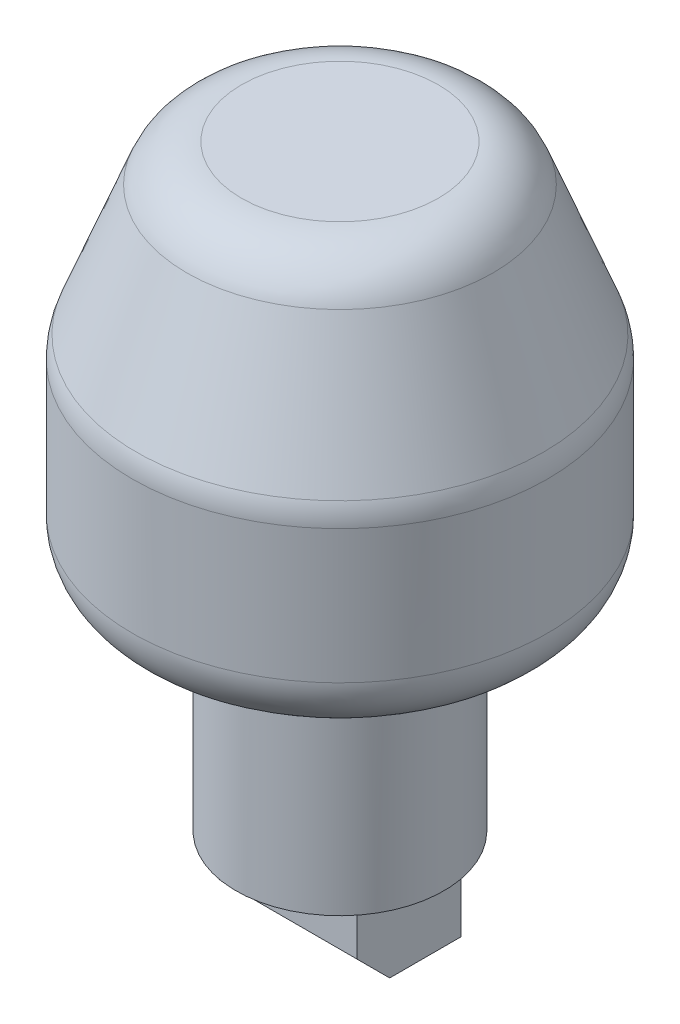
ISO-10303-21;
HEADER;
FILE_DESCRIPTION(('STEP AP214'),'2;1');
FILE_NAME('part.step','',(''),(''),'','','');
FILE_SCHEMA(('AUTOMOTIVE_DESIGN { 1 0 10303 214 1 1 1 1 }'));
ENDSEC;
DATA;
#1=APPLICATION_CONTEXT('core data for automotive mechanical design processes');
#2=APPLICATION_PROTOCOL_DEFINITION('international standard','automotive_design',2000,#1);
#3=PRODUCT_CONTEXT('',#1,'mechanical');
#4=PRODUCT('Part','Part','',(#3));
#5=PRODUCT_RELATED_PRODUCT_CATEGORY('part','',(#4));
#6=PRODUCT_DEFINITION_FORMATION('','',#4);
#7=PRODUCT_DEFINITION_CONTEXT('part definition',#1,'design');
#8=PRODUCT_DEFINITION('design','',#6,#7);
#9=PRODUCT_DEFINITION_SHAPE('','',#8);
#10=(LENGTH_UNIT() NAMED_UNIT(*) SI_UNIT(.MILLI.,.METRE.));
#11=(NAMED_UNIT(*) PLANE_ANGLE_UNIT() SI_UNIT($,.RADIAN.));
#12=(NAMED_UNIT(*) SI_UNIT($,.STERADIAN.) SOLID_ANGLE_UNIT());
#13=UNCERTAINTY_MEASURE_WITH_UNIT(LENGTH_MEASURE(1.E-05),#10,'distance_accuracy_value','');
#14=(GEOMETRIC_REPRESENTATION_CONTEXT(3) GLOBAL_UNCERTAINTY_ASSIGNED_CONTEXT((#13)) GLOBAL_UNIT_ASSIGNED_CONTEXT((#10,
#11,#12)) REPRESENTATION_CONTEXT('',''));
#15=CARTESIAN_POINT('',(0.,0.,0.));
#16=DIRECTION('',(0.,0.,1.));
#17=DIRECTION('',(1.,0.,0.));
#18=AXIS2_PLACEMENT_3D('',#15,#16,#17);
#19=CARTESIAN_POINT('',(7.4549,-9.01718142394338,0.));
#20=DIRECTION('',(0.,-1.,0.));
#21=DIRECTION('',(0.,0.,-1.));
#22=AXIS2_PLACEMENT_3D('',#19,#20,#21);
#23=PLANE('',#22);
#24=DIRECTION('',(0.,0.,1.));
#25=VECTOR('',#24,1.);
#26=CARTESIAN_POINT('',(7.3279,-9.01718142394338,0.));
#27=LINE('',#26,#25);
#28=CARTESIAN_POINT('',(7.3279,-9.01718142394338,-5.49919071197169));
#29=VERTEX_POINT('',#28);
#30=CARTESIAN_POINT('',(7.3279,-9.01718142394338,1.9430092880283));
#31=VERTEX_POINT('',#30);
#32=EDGE_CURVE('E59',#29,#31,#27,.T.);
#33=ORIENTED_EDGE('',*,*,#32,.F.);
#34=DIRECTION('',(1.,0.,0.));
#35=VECTOR('',#34,1.);
#36=CARTESIAN_POINT('',(0.,-9.01718142394338,-5.49919071197169));
#37=LINE('',#36,#35);
#38=CARTESIAN_POINT('',(2.54762,-9.01718142394338,-5.49919071197169));
#39=VERTEX_POINT('',#38);
#40=EDGE_CURVE('E210',#39,#29,#37,.T.);
#41=ORIENTED_EDGE('',*,*,#40,.F.);
#42=DIRECTION('',(0.,0.,-1.));
#43=VECTOR('',#42,1.);
#44=CARTESIAN_POINT('',(2.54762,-9.01718142394338,0.));
#45=LINE('',#44,#43);
#46=CARTESIAN_POINT('',(2.54762,-9.01718142394338,1.94300928802831));
#47=VERTEX_POINT('',#46);
#48=EDGE_CURVE('E225',#47,#39,#45,.T.);
#49=ORIENTED_EDGE('',*,*,#48,.F.);
#50=DIRECTION('',(-1.,0.,0.));
#51=VECTOR('',#50,1.);
#52=CARTESIAN_POINT('',(0.,-9.01718142394338,1.9430092880283));
#53=LINE('',#52,#51);
#54=EDGE_CURVE('E221',#31,#47,#53,.T.);
#55=ORIENTED_EDGE('',*,*,#54,.F.);
#56=EDGE_LOOP('',(#33,#41,#49,#55));
#57=FACE_BOUND('',#56,.T.);
#58=DIRECTION('',(-1.,0.,0.));
#59=VECTOR('',#58,1.);
#60=CARTESIAN_POINT('',(0.,-9.01718142394338,1.9430092880283));
#61=LINE('',#60,#59);
#62=CARTESIAN_POINT('',(-2.54762,-9.01718142394338,1.9430092880283));
#63=VERTEX_POINT('',#62);
#64=CARTESIAN_POINT('',(-7.3279,-9.01718142394338,1.9430092880283));
#65=VERTEX_POINT('',#64);
#66=EDGE_CURVE('E285',#63,#65,#61,.T.);
#67=ORIENTED_EDGE('',*,*,#66,.F.);
#68=DIRECTION('',(0.,0.,-1.));
#69=VECTOR('',#68,1.);
#70=CARTESIAN_POINT('',(-2.54762,-9.01718142394338,0.));
#71=LINE('',#70,#69);
#72=CARTESIAN_POINT('',(-2.54762,-9.01718142394338,-5.49919071197169));
#73=VERTEX_POINT('',#72);
#74=EDGE_CURVE('E263',#63,#73,#71,.T.);
#75=ORIENTED_EDGE('',*,*,#74,.T.);
#76=DIRECTION('',(1.,0.,0.));
#77=VECTOR('',#76,1.);
#78=CARTESIAN_POINT('',(0.,-9.01718142394338,-5.49919071197169));
#79=LINE('',#78,#77);
#80=CARTESIAN_POINT('',(-7.3279,-9.01718142394338,-5.49919071197169));
#81=VERTEX_POINT('',#80);
#82=EDGE_CURVE('E273',#81,#73,#79,.T.);
#83=ORIENTED_EDGE('',*,*,#82,.F.);
#84=DIRECTION('',(0.,0.,-1.));
#85=VECTOR('',#84,1.);
#86=CARTESIAN_POINT('',(-7.3279,-9.01718142394338,0.));
#87=LINE('',#86,#85);
#88=EDGE_CURVE('E288',#65,#81,#87,.T.);
#89=ORIENTED_EDGE('',*,*,#88,.F.);
#90=EDGE_LOOP('',(#67,#75,#83,#89));
#91=FACE_BOUND('',#90,.T.);
#92=DIRECTION('',(0.,0.,1.));
#93=VECTOR('',#92,1.);
#94=CARTESIAN_POINT('',(-7.4549,-9.01718142394338,0.));
#95=LINE('',#94,#93);
#96=CARTESIAN_POINT('',(-7.4549,-9.01718142394338,-5.6261907119717));
#97=VERTEX_POINT('',#96);
#98=CARTESIAN_POINT('',(-7.4549,-9.01718142394338,2.0700092880283));
#99=VERTEX_POINT('',#98);
#100=EDGE_CURVE('E323',#97,#99,#95,.T.);
#101=ORIENTED_EDGE('',*,*,#100,.F.);
#102=DIRECTION('',(-1.,0.,0.));
#103=VECTOR('',#102,1.);
#104=CARTESIAN_POINT('',(7.4549,-9.01718142394338,-5.6261907119717));
#105=LINE('',#104,#103);
#106=CARTESIAN_POINT('',(7.4549,-9.01718142394338,-5.6261907119717));
#107=VERTEX_POINT('',#106);
#108=EDGE_CURVE('E329',#107,#97,#105,.T.);
#109=ORIENTED_EDGE('',*,*,#108,.F.);
#110=DIRECTION('',(0.,0.,1.));
#111=VECTOR('',#110,1.);
#112=CARTESIAN_POINT('',(7.4549,-9.01718142394338,0.));
#113=LINE('',#112,#111);
#114=CARTESIAN_POINT('',(7.4549,-9.01718142394338,2.0700092880283));
#115=VERTEX_POINT('',#114);
#116=EDGE_CURVE('E309',#107,#115,#113,.T.);
#117=ORIENTED_EDGE('',*,*,#116,.T.);
#118=DIRECTION('',(-1.,0.,0.));
#119=VECTOR('',#118,1.);
#120=CARTESIAN_POINT('',(7.4549,-9.01718142394338,2.0700092880283));
#121=LINE('',#120,#119);
#122=EDGE_CURVE('E331',#115,#99,#121,.T.);
#123=ORIENTED_EDGE('',*,*,#122,.T.);
#124=EDGE_LOOP('',(#101,#109,#117,#123));
#125=FACE_BOUND('',#124,.T.);
#126=DIRECTION('',(-1.,0.,0.));
#127=VECTOR('',#126,1.);
#128=CARTESIAN_POINT('',(0.,-9.01718142394338,1.9430092880283));
#129=LINE('',#128,#127);
#130=CARTESIAN_POINT('',(2.42062,-9.01718142394338,1.9430092880283));
#131=VERTEX_POINT('',#130);
#132=CARTESIAN_POINT('',(-2.42062,-9.01718142394338,1.94300928802831));
#133=VERTEX_POINT('',#132);
#134=EDGE_CURVE('E253',#131,#133,#129,.T.);
#135=ORIENTED_EDGE('',*,*,#134,.F.);
#136=DIRECTION('',(0.,0.,-1.));
#137=VECTOR('',#136,1.);
#138=CARTESIAN_POINT('',(2.42062,-9.01718142394338,0.));
#139=LINE('',#138,#137);
#140=CARTESIAN_POINT('',(2.42062,-9.01718142394338,-5.49919071197169));
#141=VERTEX_POINT('',#140);
#142=EDGE_CURVE('E232',#131,#141,#139,.T.);
#143=ORIENTED_EDGE('',*,*,#142,.T.);
#144=DIRECTION('',(1.,0.,0.));
#145=VECTOR('',#144,1.);
#146=CARTESIAN_POINT('',(0.,-9.01718142394338,-5.49919071197169));
#147=LINE('',#146,#145);
#148=CARTESIAN_POINT('',(-2.42062,-9.01718142394338,-5.49919071197169));
#149=VERTEX_POINT('',#148);
#150=EDGE_CURVE('E241',#149,#141,#147,.T.);
#151=ORIENTED_EDGE('',*,*,#150,.F.);
#152=DIRECTION('',(0.,0.,-1.));
#153=VECTOR('',#152,1.);
#154=CARTESIAN_POINT('',(-2.42062,-9.01718142394338,0.));
#155=LINE('',#154,#153);
#156=EDGE_CURVE('E256',#133,#149,#155,.T.);
#157=ORIENTED_EDGE('',*,*,#156,.F.);
#158=EDGE_LOOP('',(#135,#143,#151,#157));
#159=FACE_BOUND('',#158,.T.);
#160=ADVANCED_FACE('F36',(#57,#91,#125,#159),#23,.T.);
#161=CARTESIAN_POINT('',(0.,0.,0.));
#162=DIRECTION('',(0.,1.,0.));
#163=DIRECTION('',(-1.,0.,0.));
#164=AXIS2_PLACEMENT_3D('',#161,#162,#163);
#165=PLANE('',#164);
#166=DIRECTION('',(-1.,0.,0.));
#167=VECTOR('',#166,1.);
#168=CARTESIAN_POINT('',(7.4549,0.,5.62619071197169));
#169=LINE('',#168,#167);
#170=CARTESIAN_POINT('',(7.4549,0.,5.62619071197169));
#171=VERTEX_POINT('',#170);
#172=CARTESIAN_POINT('',(-7.4549,0.,5.62619071197169));
#173=VERTEX_POINT('',#172);
#174=EDGE_CURVE('E336',#171,#173,#169,.T.);
#175=ORIENTED_EDGE('',*,*,#174,.F.);
#176=DIRECTION('',(0.,0.,-1.));
#177=VECTOR('',#176,1.);
#178=CARTESIAN_POINT('',(7.4549,0.,0.));
#179=LINE('',#178,#177);
#180=CARTESIAN_POINT('',(7.4549,0.,-5.62619071197169));
#181=VERTEX_POINT('',#180);
#182=EDGE_CURVE('E302',#171,#181,#179,.T.);
#183=ORIENTED_EDGE('',*,*,#182,.T.);
#184=DIRECTION('',(-1.,0.,0.));
#185=VECTOR('',#184,1.);
#186=CARTESIAN_POINT('',(7.4549,0.,-5.62619071197169));
#187=LINE('',#186,#185);
#188=CARTESIAN_POINT('',(-7.4549,0.,-5.62619071197169));
#189=VERTEX_POINT('',#188);
#190=EDGE_CURVE('E315',#181,#189,#187,.T.);
#191=ORIENTED_EDGE('',*,*,#190,.T.);
#192=DIRECTION('',(0.,0.,-1.));
#193=VECTOR('',#192,1.);
#194=CARTESIAN_POINT('',(-7.4549,0.,0.));
#195=LINE('',#194,#193);
#196=EDGE_CURVE('E295',#173,#189,#195,.T.);
#197=ORIENTED_EDGE('',*,*,#196,.F.);
#198=EDGE_LOOP('',(#175,#183,#191,#197));
#199=FACE_BOUND('',#198,.T.);
#200=CARTESIAN_POINT('',(0.,0.,0.));
#201=DIRECTION('',(0.,1.,0.));
#202=DIRECTION('',(-1.,0.,0.));
#203=AXIS2_PLACEMENT_3D('',#200,#201,#202);
#204=CIRCLE('',#203,11.2395);
#205=CARTESIAN_POINT('',(-11.2395,0.,0.));
#206=VERTEX_POINT('',#205);
#207=EDGE_CURVE('E341',#206,#206,#204,.T.);
#208=ORIENTED_EDGE('',*,*,#207,.F.);
#209=EDGE_LOOP('',(#208));
#210=FACE_BOUND('',#209,.T.);
#211=ADVANCED_FACE('F376',(#199,#210),#165,.F.);
#212=CARTESIAN_POINT('',(0.,64.6193127521161,0.));
#213=DIRECTION('',(0.,1.,0.));
#214=DIRECTION('',(-1.,0.,0.));
#215=AXIS2_PLACEMENT_3D('',#212,#213,#214);
#216=CYLINDRICAL_SURFACE('',#215,11.2395);
#217=CARTESIAN_POINT('',(0.,21.2344,0.));
#218=DIRECTION('',(0.,-1.,0.));
#219=DIRECTION('',(0.,0.,-1.));
#220=AXIS2_PLACEMENT_3D('',#217,#218,#219);
#221=CIRCLE('',#220,11.2395);
#222=CARTESIAN_POINT('',(-1.778,21.2344,11.0979762231679));
#223=VERTEX_POINT('',#222);
#224=CARTESIAN_POINT('',(1.778,21.2344,11.0979762231679));
#225=VERTEX_POINT('',#224);
#226=EDGE_CURVE('E183',#223,#225,#221,.F.);
#227=ORIENTED_EDGE('',*,*,#226,.F.);
#228=DIRECTION('',(0.,1.,0.));
#229=VECTOR('',#228,1.);
#230=CARTESIAN_POINT('',(-1.778,64.6193127521161,11.0979762231679));
#231=LINE('',#230,#229);
#232=CARTESIAN_POINT('',(-1.778,23.4188,11.0979762231679));
#233=VERTEX_POINT('',#232);
#234=EDGE_CURVE('E188',#233,#223,#231,.F.);
#235=ORIENTED_EDGE('',*,*,#234,.F.);
#236=CARTESIAN_POINT('',(0.,23.4188,0.));
#237=DIRECTION('',(0.,1.,0.));
#238=DIRECTION('',(-1.,0.,0.));
#239=AXIS2_PLACEMENT_3D('',#236,#237,#238);
#240=CIRCLE('',#239,11.2395);
#241=CARTESIAN_POINT('',(1.778,23.4188,11.0979762231679));
#242=VERTEX_POINT('',#241);
#243=EDGE_CURVE('E339',#242,#233,#240,.T.);
#244=ORIENTED_EDGE('',*,*,#243,.F.);
#245=DIRECTION('',(0.,1.,0.));
#246=VECTOR('',#245,1.);
#247=CARTESIAN_POINT('',(1.778,64.6193127521161,11.0979762231679));
#248=LINE('',#247,#246);
#249=EDGE_CURVE('E51',#225,#242,#248,.T.);
#250=ORIENTED_EDGE('',*,*,#249,.F.);
#251=EDGE_LOOP('',(#227,#235,#244,#250));
#252=FACE_BOUND('',#251,.T.);
#253=ORIENTED_EDGE('',*,*,#207,.T.);
#254=EDGE_LOOP('',(#253));
#255=FACE_BOUND('',#254,.T.);
#256=ADVANCED_FACE('F198',(#252,#255),#216,.T.);
#257=CARTESIAN_POINT('',(11.2395,23.4188,0.));
#258=DIRECTION('',(0.,1.,0.));
#259=DIRECTION('',(-1.,0.,0.));
#260=AXIS2_PLACEMENT_3D('',#257,#258,#259);
#261=PLANE('',#260);
#262=CARTESIAN_POINT('',(0.,23.4188,0.));
#263=DIRECTION('',(0.,1.,0.));
#264=DIRECTION('',(-1.,0.,0.));
#265=AXIS2_PLACEMENT_3D('',#262,#263,#264);
#266=CIRCLE('',#265,16.123370687632);
#267=CARTESIAN_POINT('',(-16.123370687632,23.4188,0.));
#268=VERTEX_POINT('',#267);
#269=EDGE_CURVE('E350',#268,#268,#266,.F.);
#270=ORIENTED_EDGE('',*,*,#269,.T.);
#271=EDGE_LOOP('',(#270));
#272=FACE_BOUND('',#271,.T.);
#273=ORIENTED_EDGE('',*,*,#243,.T.);
#274=DIRECTION('',(0.,0.,1.));
#275=VECTOR('',#274,1.);
#276=CARTESIAN_POINT('',(-1.778,23.4188,-22.474370687632));
#277=LINE('',#276,#275);
#278=CARTESIAN_POINT('',(-1.778,23.4188,14.29512));
#279=VERTEX_POINT('',#278);
#280=EDGE_CURVE('E193',#233,#279,#277,.T.);
#281=ORIENTED_EDGE('',*,*,#280,.T.);
#282=DIRECTION('',(-1.,0.,0.));
#283=VECTOR('',#282,1.);
#284=CARTESIAN_POINT('',(-1.778,23.4188,14.29512));
#285=LINE('',#284,#283);
#286=CARTESIAN_POINT('',(1.778,23.4188,14.29512));
#287=VERTEX_POINT('',#286);
#288=EDGE_CURVE('E706',#287,#279,#285,.T.);
#289=ORIENTED_EDGE('',*,*,#288,.F.);
#290=DIRECTION('',(0.,0.,1.));
#291=VECTOR('',#290,1.);
#292=CARTESIAN_POINT('',(1.778,23.4188,-22.474370687632));
#293=LINE('',#292,#291);
#294=EDGE_CURVE('E222',#242,#287,#293,.T.);
#295=ORIENTED_EDGE('',*,*,#294,.F.);
#296=EDGE_LOOP('',(#273,#281,#289,#295));
#297=FACE_BOUND('',#296,.T.);
#298=ADVANCED_FACE('F404',(#272,#297),#261,.F.);
#299=CARTESIAN_POINT('',(0.,64.6193127521161,0.));
#300=DIRECTION('',(0.,1.,0.));
#301=DIRECTION('',(-1.,0.,0.));
#302=AXIS2_PLACEMENT_3D('',#299,#300,#301);
#303=CYLINDRICAL_SURFACE('',#302,22.473370687632);
#304=CARTESIAN_POINT('',(0.,29.7688,0.));
#305=DIRECTION('',(0.,1.,0.));
#306=DIRECTION('',(-1.,0.,0.));
#307=AXIS2_PLACEMENT_3D('',#304,#305,#306);
#308=CIRCLE('',#307,22.473370687632);
#309=CARTESIAN_POINT('',(-22.473370687632,29.7688,0.));
#310=VERTEX_POINT('',#309);
#311=EDGE_CURVE('E347',#310,#310,#308,.T.);
#312=ORIENTED_EDGE('',*,*,#311,.T.);
#313=EDGE_LOOP('',(#312));
#314=FACE_BOUND('',#313,.T.);
#315=CARTESIAN_POINT('',(0.,44.2210933640308,0.));
#316=DIRECTION('',(0.,-1.,0.));
#317=DIRECTION('',(1.,0.,0.));
#318=AXIS2_PLACEMENT_3D('',#315,#316,#317);
#319=CIRCLE('',#318,22.473370687632);
#320=CARTESIAN_POINT('',(22.473370687632,44.2210933640308,0.));
#321=VERTEX_POINT('',#320);
#322=EDGE_CURVE('E344',#321,#321,#319,.T.);
#323=ORIENTED_EDGE('',*,*,#322,.T.);
#324=EDGE_LOOP('',(#323));
#325=FACE_BOUND('',#324,.T.);
#326=ADVANCED_FACE('F401',(#314,#325),#303,.T.);
#327=CARTESIAN_POINT('',(0.,45.4152,0.));
#328=DIRECTION('',(0.,-1.,0.));
#329=DIRECTION('',(1.,0.,0.));
#330=AXIS2_PLACEMENT_3D('',#327,#328,#329);
#331=CONICAL_SURFACE('',#330,22.473370687632,0.371755130674789);
#332=CARTESIAN_POINT('',(0.,46.5277386775342,0.));
#333=DIRECTION('',(0.,1.,0.));
#334=DIRECTION('',(-1.,0.,0.));
#335=AXIS2_PLACEMENT_3D('',#332,#333,#334);
#336=CIRCLE('',#335,22.0396099828003);
#337=CARTESIAN_POINT('',(-22.0396099828003,46.5277386775342,0.));
#338=VERTEX_POINT('',#337);
#339=EDGE_CURVE('E44',#338,#338,#336,.T.);
#340=ORIENTED_EDGE('',*,*,#339,.T.);
#341=EDGE_LOOP('',(#340));
#342=FACE_BOUND('',#341,.T.);
#343=CARTESIAN_POINT('',(0.,60.5759580656195,0.));
#344=DIRECTION('',(0.,1.,0.));
#345=DIRECTION('',(-1.,0.,0.));
#346=AXIS2_PLACEMENT_3D('',#343,#344,#345);
#347=CIRCLE('',#346,16.5624381177172);
#348=CARTESIAN_POINT('',(-16.5624381177172,60.5759580656195,0.));
#349=VERTEX_POINT('',#348);
#350=EDGE_CURVE('E353',#349,#349,#347,.F.);
#351=ORIENTED_EDGE('',*,*,#350,.T.);
#352=EDGE_LOOP('',(#351));
#353=FACE_BOUND('',#352,.T.);
#354=ADVANCED_FACE('F358',(#342,#353),#331,.T.);
#355=CARTESIAN_POINT('',(14.986,64.6193127521161,0.));
#356=DIRECTION('',(0.,-1.,0.));
#357=DIRECTION('',(1.,0.,0.));
#358=AXIS2_PLACEMENT_3D('',#355,#356,#357);
#359=PLANE('',#358);
#360=CARTESIAN_POINT('',(0.,64.6193127521161,0.));
#361=DIRECTION('',(0.,-1.,0.));
#362=DIRECTION('',(1.,0.,0.));
#363=AXIS2_PLACEMENT_3D('',#360,#361,#362);
#364=CIRCLE('',#363,10.6461988225489);
#365=CARTESIAN_POINT('',(10.6461988225489,64.6193127521161,0.));
#366=VERTEX_POINT('',#365);
#367=EDGE_CURVE('E11',#366,#366,#364,.F.);
#368=ORIENTED_EDGE('',*,*,#367,.T.);
#369=EDGE_LOOP('',(#368));
#370=FACE_BOUND('',#369,.T.);
#371=ADVANCED_FACE('F371',(#370),#359,.F.);
#372=CARTESIAN_POINT('',(0.,29.7688,0.));
#373=DIRECTION('',(0.,1.,0.));
#374=DIRECTION('',(-1.,0.,0.));
#375=AXIS2_PLACEMENT_3D('',#372,#373,#374);
#376=TOROIDAL_SURFACE('',#375,16.123370687632,6.35);
#377=ORIENTED_EDGE('',*,*,#269,.F.);
#378=EDGE_LOOP('',(#377));
#379=FACE_BOUND('',#378,.T.);
#380=ORIENTED_EDGE('',*,*,#311,.F.);
#381=EDGE_LOOP('',(#380));
#382=FACE_BOUND('',#381,.T.);
#383=ADVANCED_FACE('F363',(#379,#382),#376,.T.);
#384=CARTESIAN_POINT('',(0.,44.2210933640308,0.));
#385=DIRECTION('',(0.,-1.,0.));
#386=DIRECTION('',(1.,0.,0.));
#387=AXIS2_PLACEMENT_3D('',#384,#385,#386);
#388=TOROIDAL_SURFACE('',#387,16.123370687632,6.35);
#389=ORIENTED_EDGE('',*,*,#322,.F.);
#390=EDGE_LOOP('',(#389));
#391=FACE_BOUND('',#390,.T.);
#392=ORIENTED_EDGE('',*,*,#339,.F.);
#393=EDGE_LOOP('',(#392));
#394=FACE_BOUND('',#393,.T.);
#395=ADVANCED_FACE('F361',(#391,#394),#388,.T.);
#396=CARTESIAN_POINT('',(0.,58.2693127521161,0.));
#397=DIRECTION('',(0.,-1.,0.));
#398=DIRECTION('',(1.,0.,0.));
#399=AXIS2_PLACEMENT_3D('',#396,#397,#398);
#400=TOROIDAL_SURFACE('',#399,10.6461988225489,6.35);
#401=ORIENTED_EDGE('',*,*,#350,.F.);
#402=EDGE_LOOP('',(#401));
#403=FACE_BOUND('',#402,.T.);
#404=ORIENTED_EDGE('',*,*,#367,.F.);
#405=EDGE_LOOP('',(#404));
#406=FACE_BOUND('',#405,.T.);
#407=ADVANCED_FACE('F38',(#403,#406),#400,.T.);
#408=CARTESIAN_POINT('',(7.4549,0.,5.62619071197169));
#409=DIRECTION('',(0.,0.,-1.));
#410=DIRECTION('',(0.,1.,0.));
#411=AXIS2_PLACEMENT_3D('',#408,#409,#410);
#412=PLANE('',#411);
#413=DIRECTION('',(0.,-1.,0.));
#414=VECTOR('',#413,1.);
#415=CARTESIAN_POINT('',(-7.4549,0.,5.62619071197169));
#416=LINE('',#415,#414);
#417=CARTESIAN_POINT('',(-7.4549,-5.461,5.62619071197169));
#418=VERTEX_POINT('',#417);
#419=EDGE_CURVE('E318',#173,#418,#416,.T.);
#420=ORIENTED_EDGE('',*,*,#419,.T.);
#421=DIRECTION('',(-1.,0.,0.));
#422=VECTOR('',#421,1.);
#423=CARTESIAN_POINT('',(7.4549,-5.461,5.62619071197169));
#424=LINE('',#423,#422);
#425=CARTESIAN_POINT('',(7.4549,-5.461,5.62619071197169));
#426=VERTEX_POINT('',#425);
#427=EDGE_CURVE('E333',#426,#418,#424,.T.);
#428=ORIENTED_EDGE('',*,*,#427,.F.);
#429=DIRECTION('',(0.,-1.,0.));
#430=VECTOR('',#429,1.);
#431=CARTESIAN_POINT('',(7.4549,0.,5.62619071197169));
#432=LINE('',#431,#430);
#433=EDGE_CURVE('E304',#171,#426,#432,.T.);
#434=ORIENTED_EDGE('',*,*,#433,.F.);
#435=ORIENTED_EDGE('',*,*,#174,.T.);
#436=EDGE_LOOP('',(#420,#428,#434,#435));
#437=FACE_BOUND('',#436,.T.);
#438=ADVANCED_FACE('F369',(#437),#412,.F.);
#439=CARTESIAN_POINT('',(7.4549,-5.54359535598586,5.54359535598584));
#440=DIRECTION('',(0.,0.707106781186549,-0.707106781186546));
#441=DIRECTION('',(0.,0.707106781186546,0.707106781186549));
#442=AXIS2_PLACEMENT_3D('',#439,#440,#441);
#443=PLANE('',#442);
#444=DIRECTION('',(0.,-0.707106781186546,-0.707106781186549));
#445=VECTOR('',#444,1.);
#446=CARTESIAN_POINT('',(-7.4549,-5.54359535598586,5.54359535598584));
#447=LINE('',#446,#445);
#448=EDGE_CURVE('E320',#418,#99,#447,.T.);
#449=ORIENTED_EDGE('',*,*,#448,.T.);
#450=ORIENTED_EDGE('',*,*,#122,.F.);
#451=DIRECTION('',(0.,-0.707106781186546,-0.707106781186549));
#452=VECTOR('',#451,1.);
#453=CARTESIAN_POINT('',(7.4549,-5.54359535598586,5.54359535598584));
#454=LINE('',#453,#452);
#455=EDGE_CURVE('E307',#426,#115,#454,.T.);
#456=ORIENTED_EDGE('',*,*,#455,.F.);
#457=ORIENTED_EDGE('',*,*,#427,.T.);
#458=EDGE_LOOP('',(#449,#450,#456,#457));
#459=FACE_BOUND('',#458,.T.);
#460=ADVANCED_FACE('F389',(#459),#443,.F.);
#461=CARTESIAN_POINT('',(7.4549,0.,-5.62619071197169));
#462=DIRECTION('',(0.,0.,-1.));
#463=DIRECTION('',(0.,1.,0.));
#464=AXIS2_PLACEMENT_3D('',#461,#462,#463);
#465=PLANE('',#464);
#466=DIRECTION('',(0.,-1.,0.));
#467=VECTOR('',#466,1.);
#468=CARTESIAN_POINT('',(-7.4549,0.,-5.62619071197169));
#469=LINE('',#468,#467);
#470=EDGE_CURVE('E305',#189,#97,#469,.T.);
#471=ORIENTED_EDGE('',*,*,#470,.F.);
#472=ORIENTED_EDGE('',*,*,#190,.F.);
#473=DIRECTION('',(0.,-1.,0.));
#474=VECTOR('',#473,1.);
#475=CARTESIAN_POINT('',(7.4549,0.,-5.62619071197169));
#476=LINE('',#475,#474);
#477=EDGE_CURVE('E312',#181,#107,#476,.T.);
#478=ORIENTED_EDGE('',*,*,#477,.T.);
#479=ORIENTED_EDGE('',*,*,#108,.T.);
#480=EDGE_LOOP('',(#471,#472,#478,#479));
#481=FACE_BOUND('',#480,.T.);
#482=ADVANCED_FACE('F387',(#481),#465,.T.);
#483=CARTESIAN_POINT('',(7.4549,0.,0.));
#484=DIRECTION('',(1.,0.,0.));
#485=DIRECTION('',(0.,0.,-1.));
#486=AXIS2_PLACEMENT_3D('',#483,#484,#485);
#487=PLANE('',#486);
#488=ORIENTED_EDGE('',*,*,#182,.F.);
#489=ORIENTED_EDGE('',*,*,#433,.T.);
#490=ORIENTED_EDGE('',*,*,#455,.T.);
#491=ORIENTED_EDGE('',*,*,#116,.F.);
#492=ORIENTED_EDGE('',*,*,#477,.F.);
#493=EDGE_LOOP('',(#488,#489,#490,#491,#492));
#494=FACE_BOUND('',#493,.T.);
#495=ADVANCED_FACE('F477',(#494),#487,.T.);
#496=CARTESIAN_POINT('',(-7.4549,0.,0.));
#497=DIRECTION('',(1.,0.,0.));
#498=DIRECTION('',(0.,0.,-1.));
#499=AXIS2_PLACEMENT_3D('',#496,#497,#498);
#500=PLANE('',#499);
#501=ORIENTED_EDGE('',*,*,#196,.T.);
#502=ORIENTED_EDGE('',*,*,#470,.T.);
#503=ORIENTED_EDGE('',*,*,#100,.T.);
#504=ORIENTED_EDGE('',*,*,#448,.F.);
#505=ORIENTED_EDGE('',*,*,#419,.F.);
#506=EDGE_LOOP('',(#501,#502,#503,#504,#505));
#507=FACE_BOUND('',#506,.T.);
#508=ADVANCED_FACE('F486',(#507),#500,.F.);
#509=CARTESIAN_POINT('',(-2.54762,-6.47718142394338,0.));
#510=DIRECTION('',(-1.,0.,0.));
#511=DIRECTION('',(0.,0.,1.));
#512=AXIS2_PLACEMENT_3D('',#509,#510,#511);
#513=PLANE('',#512);
#514=ORIENTED_EDGE('',*,*,#74,.F.);
#515=DIRECTION('',(0.,-1.,0.));
#516=VECTOR('',#515,1.);
#517=CARTESIAN_POINT('',(-2.54762,-6.47718142394338,1.94300928802831));
#518=LINE('',#517,#516);
#519=CARTESIAN_POINT('',(-2.54762,-6.47718142394338,1.94300928802831));
#520=VERTEX_POINT('',#519);
#521=EDGE_CURVE('E282',#520,#63,#518,.T.);
#522=ORIENTED_EDGE('',*,*,#521,.F.);
#523=DIRECTION('',(0.,0.,-1.));
#524=VECTOR('',#523,1.);
#525=CARTESIAN_POINT('',(-2.54762,-6.47718142394338,0.));
#526=LINE('',#525,#524);
#527=CARTESIAN_POINT('',(-2.54762,-6.47718142394338,-5.49919071197169));
#528=VERTEX_POINT('',#527);
#529=EDGE_CURVE('E270',#520,#528,#526,.T.);
#530=ORIENTED_EDGE('',*,*,#529,.T.);
#531=DIRECTION('',(0.,-1.,0.));
#532=VECTOR('',#531,1.);
#533=CARTESIAN_POINT('',(-2.54762,-6.47718142394338,-5.49919071197169));
#534=LINE('',#533,#532);
#535=EDGE_CURVE('E293',#528,#73,#534,.T.);
#536=ORIENTED_EDGE('',*,*,#535,.T.);
#537=EDGE_LOOP('',(#514,#522,#530,#536));
#538=FACE_BOUND('',#537,.T.);
#539=ADVANCED_FACE('F495',(#538),#513,.T.);
#540=CARTESIAN_POINT('',(0.,-6.47718142394338,-5.49919071197169));
#541=DIRECTION('',(0.,0.,-1.));
#542=DIRECTION('',(0.,1.,0.));
#543=AXIS2_PLACEMENT_3D('',#540,#541,#542);
#544=PLANE('',#543);
#545=ORIENTED_EDGE('',*,*,#82,.T.);
#546=ORIENTED_EDGE('',*,*,#535,.F.);
#547=DIRECTION('',(1.,0.,0.));
#548=VECTOR('',#547,1.);
#549=CARTESIAN_POINT('',(0.,-6.47718142394338,-5.49919071197169));
#550=LINE('',#549,#548);
#551=CARTESIAN_POINT('',(-7.3279,-6.47718142394338,-5.49919071197169));
#552=VERTEX_POINT('',#551);
#553=EDGE_CURVE('E279',#552,#528,#550,.T.);
#554=ORIENTED_EDGE('',*,*,#553,.F.);
#555=DIRECTION('',(0.,-1.,0.));
#556=VECTOR('',#555,1.);
#557=CARTESIAN_POINT('',(-7.3279,-6.47718142394338,-5.49919071197169));
#558=LINE('',#557,#556);
#559=EDGE_CURVE('E296',#552,#81,#558,.T.);
#560=ORIENTED_EDGE('',*,*,#559,.T.);
#561=EDGE_LOOP('',(#545,#546,#554,#560));
#562=FACE_BOUND('',#561,.T.);
#563=ADVANCED_FACE('F510',(#562),#544,.F.);
#564=CARTESIAN_POINT('',(-7.3279,-6.47718142394338,0.));
#565=DIRECTION('',(-1.,0.,0.));
#566=DIRECTION('',(0.,0.,1.));
#567=AXIS2_PLACEMENT_3D('',#564,#565,#566);
#568=PLANE('',#567);
#569=ORIENTED_EDGE('',*,*,#88,.T.);
#570=ORIENTED_EDGE('',*,*,#559,.F.);
#571=DIRECTION('',(0.,0.,-1.));
#572=VECTOR('',#571,1.);
#573=CARTESIAN_POINT('',(-7.3279,-6.47718142394338,0.));
#574=LINE('',#573,#572);
#575=CARTESIAN_POINT('',(-7.3279,-6.47718142394338,1.94300928802831));
#576=VERTEX_POINT('',#575);
#577=EDGE_CURVE('E276',#576,#552,#574,.T.);
#578=ORIENTED_EDGE('',*,*,#577,.F.);
#579=DIRECTION('',(0.,-1.,0.));
#580=VECTOR('',#579,1.);
#581=CARTESIAN_POINT('',(-7.3279,-6.47718142394338,1.94300928802831));
#582=LINE('',#581,#580);
#583=EDGE_CURVE('E298',#576,#65,#582,.T.);
#584=ORIENTED_EDGE('',*,*,#583,.T.);
#585=EDGE_LOOP('',(#569,#570,#578,#584));
#586=FACE_BOUND('',#585,.T.);
#587=ADVANCED_FACE('F522',(#586),#568,.F.);
#588=CARTESIAN_POINT('',(0.,-6.47718142394338,1.94300928802831));
#589=DIRECTION('',(0.,0.,1.));
#590=DIRECTION('',(0.,-1.,0.));
#591=AXIS2_PLACEMENT_3D('',#588,#589,#590);
#592=PLANE('',#591);
#593=ORIENTED_EDGE('',*,*,#66,.T.);
#594=ORIENTED_EDGE('',*,*,#583,.F.);
#595=DIRECTION('',(-1.,0.,0.));
#596=VECTOR('',#595,1.);
#597=CARTESIAN_POINT('',(0.,-6.47718142394338,1.94300928802831));
#598=LINE('',#597,#596);
#599=EDGE_CURVE('E272',#520,#576,#598,.T.);
#600=ORIENTED_EDGE('',*,*,#599,.F.);
#601=ORIENTED_EDGE('',*,*,#521,.T.);
#602=EDGE_LOOP('',(#593,#594,#600,#601));
#603=FACE_BOUND('',#602,.T.);
#604=ADVANCED_FACE('F535',(#603),#592,.F.);
#605=CARTESIAN_POINT('',(0.,-6.47718142394338,0.));
#606=DIRECTION('',(0.,-1.,0.));
#607=DIRECTION('',(0.,0.,-1.));
#608=AXIS2_PLACEMENT_3D('',#605,#606,#607);
#609=PLANE('',#608);
#610=ORIENTED_EDGE('',*,*,#529,.F.);
#611=ORIENTED_EDGE('',*,*,#599,.T.);
#612=ORIENTED_EDGE('',*,*,#577,.T.);
#613=ORIENTED_EDGE('',*,*,#553,.T.);
#614=EDGE_LOOP('',(#610,#611,#612,#613));
#615=FACE_BOUND('',#614,.T.);
#616=ADVANCED_FACE('F548',(#615),#609,.T.);
#617=CARTESIAN_POINT('',(2.42062,-6.47718142394338,0.));
#618=DIRECTION('',(-1.,0.,0.));
#619=DIRECTION('',(0.,0.,1.));
#620=AXIS2_PLACEMENT_3D('',#617,#618,#619);
#621=PLANE('',#620);
#622=ORIENTED_EDGE('',*,*,#142,.F.);
#623=DIRECTION('',(0.,-1.,0.));
#624=VECTOR('',#623,1.);
#625=CARTESIAN_POINT('',(2.42062,-6.47718142394338,1.94300928802831));
#626=LINE('',#625,#624);
#627=CARTESIAN_POINT('',(2.42062,-6.47718142394338,1.94300928802831));
#628=VERTEX_POINT('',#627);
#629=EDGE_CURVE('E250',#628,#131,#626,.T.);
#630=ORIENTED_EDGE('',*,*,#629,.F.);
#631=DIRECTION('',(0.,0.,-1.));
#632=VECTOR('',#631,1.);
#633=CARTESIAN_POINT('',(2.42062,-6.47718142394338,0.));
#634=LINE('',#633,#632);
#635=CARTESIAN_POINT('',(2.42062,-6.47718142394338,-5.49919071197169));
#636=VERTEX_POINT('',#635);
#637=EDGE_CURVE('E238',#628,#636,#634,.T.);
#638=ORIENTED_EDGE('',*,*,#637,.T.);
#639=DIRECTION('',(0.,-1.,0.));
#640=VECTOR('',#639,1.);
#641=CARTESIAN_POINT('',(2.42062,-6.47718142394338,-5.49919071197169));
#642=LINE('',#641,#640);
#643=EDGE_CURVE('E261',#636,#141,#642,.T.);
#644=ORIENTED_EDGE('',*,*,#643,.T.);
#645=EDGE_LOOP('',(#622,#630,#638,#644));
#646=FACE_BOUND('',#645,.T.);
#647=ADVANCED_FACE('F559',(#646),#621,.T.);
#648=CARTESIAN_POINT('',(0.,-6.47718142394338,-5.49919071197169));
#649=DIRECTION('',(0.,0.,-1.));
#650=DIRECTION('',(0.,1.,0.));
#651=AXIS2_PLACEMENT_3D('',#648,#649,#650);
#652=PLANE('',#651);
#653=ORIENTED_EDGE('',*,*,#150,.T.);
#654=ORIENTED_EDGE('',*,*,#643,.F.);
#655=DIRECTION('',(1.,0.,0.));
#656=VECTOR('',#655,1.);
#657=CARTESIAN_POINT('',(0.,-6.47718142394338,-5.49919071197169));
#658=LINE('',#657,#656);
#659=CARTESIAN_POINT('',(-2.42062,-6.47718142394338,-5.49919071197169));
#660=VERTEX_POINT('',#659);
#661=EDGE_CURVE('E247',#660,#636,#658,.T.);
#662=ORIENTED_EDGE('',*,*,#661,.F.);
#663=DIRECTION('',(0.,-1.,0.));
#664=VECTOR('',#663,1.);
#665=CARTESIAN_POINT('',(-2.42062,-6.47718142394338,-5.49919071197169));
#666=LINE('',#665,#664);
#667=EDGE_CURVE('E264',#660,#149,#666,.T.);
#668=ORIENTED_EDGE('',*,*,#667,.T.);
#669=EDGE_LOOP('',(#653,#654,#662,#668));
#670=FACE_BOUND('',#669,.T.);
#671=ADVANCED_FACE('F569',(#670),#652,.F.);
#672=CARTESIAN_POINT('',(-2.42062,-6.47718142394338,0.));
#673=DIRECTION('',(-1.,0.,0.));
#674=DIRECTION('',(0.,0.,1.));
#675=AXIS2_PLACEMENT_3D('',#672,#673,#674);
#676=PLANE('',#675);
#677=ORIENTED_EDGE('',*,*,#156,.T.);
#678=ORIENTED_EDGE('',*,*,#667,.F.);
#679=DIRECTION('',(0.,0.,-1.));
#680=VECTOR('',#679,1.);
#681=CARTESIAN_POINT('',(-2.42062,-6.47718142394338,0.));
#682=LINE('',#681,#680);
#683=CARTESIAN_POINT('',(-2.42062,-6.47718142394338,1.94300928802831));
#684=VERTEX_POINT('',#683);
#685=EDGE_CURVE('E244',#684,#660,#682,.T.);
#686=ORIENTED_EDGE('',*,*,#685,.F.);
#687=DIRECTION('',(0.,-1.,0.));
#688=VECTOR('',#687,1.);
#689=CARTESIAN_POINT('',(-2.42062,-6.47718142394338,1.94300928802831));
#690=LINE('',#689,#688);
#691=EDGE_CURVE('E266',#684,#133,#690,.T.);
#692=ORIENTED_EDGE('',*,*,#691,.T.);
#693=EDGE_LOOP('',(#677,#678,#686,#692));
#694=FACE_BOUND('',#693,.T.);
#695=ADVANCED_FACE('F580',(#694),#676,.F.);
#696=CARTESIAN_POINT('',(0.,-6.47718142394338,1.94300928802831));
#697=DIRECTION('',(0.,0.,1.));
#698=DIRECTION('',(0.,-1.,0.));
#699=AXIS2_PLACEMENT_3D('',#696,#697,#698);
#700=PLANE('',#699);
#701=ORIENTED_EDGE('',*,*,#134,.T.);
#702=ORIENTED_EDGE('',*,*,#691,.F.);
#703=DIRECTION('',(-1.,0.,0.));
#704=VECTOR('',#703,1.);
#705=CARTESIAN_POINT('',(0.,-6.47718142394338,1.94300928802831));
#706=LINE('',#705,#704);
#707=EDGE_CURVE('E240',#628,#684,#706,.T.);
#708=ORIENTED_EDGE('',*,*,#707,.F.);
#709=ORIENTED_EDGE('',*,*,#629,.T.);
#710=EDGE_LOOP('',(#701,#702,#708,#709));
#711=FACE_BOUND('',#710,.T.);
#712=ADVANCED_FACE('F591',(#711),#700,.F.);
#713=CARTESIAN_POINT('',(0.,-6.47718142394338,0.));
#714=DIRECTION('',(0.,-1.,0.));
#715=DIRECTION('',(0.,0.,-1.));
#716=AXIS2_PLACEMENT_3D('',#713,#714,#715);
#717=PLANE('',#716);
#718=ORIENTED_EDGE('',*,*,#637,.F.);
#719=ORIENTED_EDGE('',*,*,#707,.T.);
#720=ORIENTED_EDGE('',*,*,#685,.T.);
#721=ORIENTED_EDGE('',*,*,#661,.T.);
#722=EDGE_LOOP('',(#718,#719,#720,#721));
#723=FACE_BOUND('',#722,.T.);
#724=ADVANCED_FACE('F602',(#723),#717,.T.);
#725=CARTESIAN_POINT('',(7.3279,-6.47718142394338,0.));
#726=DIRECTION('',(1.,0.,0.));
#727=DIRECTION('',(0.,0.,-1.));
#728=AXIS2_PLACEMENT_3D('',#725,#726,#727);
#729=PLANE('',#728);
#730=ORIENTED_EDGE('',*,*,#32,.T.);
#731=DIRECTION('',(0.,-1.,0.));
#732=VECTOR('',#731,1.);
#733=CARTESIAN_POINT('',(7.3279,-6.47718142394338,1.94300928802831));
#734=LINE('',#733,#732);
#735=CARTESIAN_POINT('',(7.3279,-6.47718142394338,1.94300928802831));
#736=VERTEX_POINT('',#735);
#737=EDGE_CURVE('E219',#736,#31,#734,.T.);
#738=ORIENTED_EDGE('',*,*,#737,.F.);
#739=DIRECTION('',(0.,0.,1.));
#740=VECTOR('',#739,1.);
#741=CARTESIAN_POINT('',(7.3279,-6.47718142394338,0.));
#742=LINE('',#741,#740);
#743=CARTESIAN_POINT('',(7.3279,-6.47718142394338,-5.49919071197169));
#744=VERTEX_POINT('',#743);
#745=EDGE_CURVE('E206',#744,#736,#742,.T.);
#746=ORIENTED_EDGE('',*,*,#745,.F.);
#747=DIRECTION('',(0.,-1.,0.));
#748=VECTOR('',#747,1.);
#749=CARTESIAN_POINT('',(7.3279,-6.47718142394338,-5.49919071197169));
#750=LINE('',#749,#748);
#751=EDGE_CURVE('E230',#744,#29,#750,.T.);
#752=ORIENTED_EDGE('',*,*,#751,.T.);
#753=EDGE_LOOP('',(#730,#738,#746,#752));
#754=FACE_BOUND('',#753,.T.);
#755=ADVANCED_FACE('F613',(#754),#729,.F.);
#756=CARTESIAN_POINT('',(0.,-6.47718142394338,-5.49919071197169));
#757=DIRECTION('',(0.,0.,-1.));
#758=DIRECTION('',(0.,1.,0.));
#759=AXIS2_PLACEMENT_3D('',#756,#757,#758);
#760=PLANE('',#759);
#761=ORIENTED_EDGE('',*,*,#40,.T.);
#762=ORIENTED_EDGE('',*,*,#751,.F.);
#763=DIRECTION('',(1.,0.,0.));
#764=VECTOR('',#763,1.);
#765=CARTESIAN_POINT('',(0.,-6.47718142394338,-5.49919071197169));
#766=LINE('',#765,#764);
#767=CARTESIAN_POINT('',(2.54762,-6.47718142394338,-5.49919071197169));
#768=VERTEX_POINT('',#767);
#769=EDGE_CURVE('E216',#768,#744,#766,.T.);
#770=ORIENTED_EDGE('',*,*,#769,.F.);
#771=DIRECTION('',(0.,-1.,0.));
#772=VECTOR('',#771,1.);
#773=CARTESIAN_POINT('',(2.54762,-6.47718142394338,-5.49919071197169));
#774=LINE('',#773,#772);
#775=EDGE_CURVE('E233',#768,#39,#774,.T.);
#776=ORIENTED_EDGE('',*,*,#775,.T.);
#777=EDGE_LOOP('',(#761,#762,#770,#776));
#778=FACE_BOUND('',#777,.T.);
#779=ADVANCED_FACE('F623',(#778),#760,.F.);
#780=CARTESIAN_POINT('',(2.54762,-6.47718142394338,0.));
#781=DIRECTION('',(-1.,0.,0.));
#782=DIRECTION('',(0.,0.,1.));
#783=AXIS2_PLACEMENT_3D('',#780,#781,#782);
#784=PLANE('',#783);
#785=ORIENTED_EDGE('',*,*,#48,.T.);
#786=ORIENTED_EDGE('',*,*,#775,.F.);
#787=DIRECTION('',(0.,0.,-1.));
#788=VECTOR('',#787,1.);
#789=CARTESIAN_POINT('',(2.54762,-6.47718142394338,0.));
#790=LINE('',#789,#788);
#791=CARTESIAN_POINT('',(2.54762,-6.47718142394338,1.94300928802831));
#792=VERTEX_POINT('',#791);
#793=EDGE_CURVE('E213',#792,#768,#790,.T.);
#794=ORIENTED_EDGE('',*,*,#793,.F.);
#795=DIRECTION('',(0.,-1.,0.));
#796=VECTOR('',#795,1.);
#797=CARTESIAN_POINT('',(2.54762,-6.47718142394338,1.94300928802831));
#798=LINE('',#797,#796);
#799=EDGE_CURVE('E235',#792,#47,#798,.T.);
#800=ORIENTED_EDGE('',*,*,#799,.T.);
#801=EDGE_LOOP('',(#785,#786,#794,#800));
#802=FACE_BOUND('',#801,.T.);
#803=ADVANCED_FACE('F632',(#802),#784,.F.);
#804=CARTESIAN_POINT('',(0.,-6.47718142394338,1.94300928802831));
#805=DIRECTION('',(0.,0.,1.));
#806=DIRECTION('',(0.,-1.,0.));
#807=AXIS2_PLACEMENT_3D('',#804,#805,#806);
#808=PLANE('',#807);
#809=ORIENTED_EDGE('',*,*,#54,.T.);
#810=ORIENTED_EDGE('',*,*,#799,.F.);
#811=DIRECTION('',(-1.,0.,0.));
#812=VECTOR('',#811,1.);
#813=CARTESIAN_POINT('',(0.,-6.47718142394338,1.94300928802831));
#814=LINE('',#813,#812);
#815=EDGE_CURVE('E209',#736,#792,#814,.T.);
#816=ORIENTED_EDGE('',*,*,#815,.F.);
#817=ORIENTED_EDGE('',*,*,#737,.T.);
#818=EDGE_LOOP('',(#809,#810,#816,#817));
#819=FACE_BOUND('',#818,.T.);
#820=ADVANCED_FACE('F642',(#819),#808,.F.);
#821=CARTESIAN_POINT('',(0.,-6.47718142394338,0.));
#822=DIRECTION('',(0.,-1.,0.));
#823=DIRECTION('',(0.,0.,-1.));
#824=AXIS2_PLACEMENT_3D('',#821,#822,#823);
#825=PLANE('',#824);
#826=ORIENTED_EDGE('',*,*,#745,.T.);
#827=ORIENTED_EDGE('',*,*,#815,.T.);
#828=ORIENTED_EDGE('',*,*,#793,.T.);
#829=ORIENTED_EDGE('',*,*,#769,.T.);
#830=EDGE_LOOP('',(#826,#827,#828,#829));
#831=FACE_BOUND('',#830,.T.);
#832=ADVANCED_FACE('F651',(#831),#825,.T.);
#833=CARTESIAN_POINT('',(0.,0.,14.29512));
#834=DIRECTION('',(0.,0.,-1.));
#835=DIRECTION('',(-1.,0.,0.));
#836=AXIS2_PLACEMENT_3D('',#833,#834,#835);
#837=PLANE('',#836);
#838=DIRECTION('',(0.,1.,0.));
#839=VECTOR('',#838,1.);
#840=CARTESIAN_POINT('',(1.778,21.2344,14.29512));
#841=LINE('',#840,#839);
#842=CARTESIAN_POINT('',(1.778,21.2344,14.29512));
#843=VERTEX_POINT('',#842);
#844=EDGE_CURVE('E703',#843,#287,#841,.T.);
#845=ORIENTED_EDGE('',*,*,#844,.T.);
#846=ORIENTED_EDGE('',*,*,#288,.T.);
#847=DIRECTION('',(0.,-1.,0.));
#848=VECTOR('',#847,1.);
#849=CARTESIAN_POINT('',(-1.778,21.2344,14.29512));
#850=LINE('',#849,#848);
#851=CARTESIAN_POINT('',(-1.778,21.2344,14.29512));
#852=VERTEX_POINT('',#851);
#853=EDGE_CURVE('E708',#279,#852,#850,.T.);
#854=ORIENTED_EDGE('',*,*,#853,.T.);
#855=DIRECTION('',(1.,0.,0.));
#856=VECTOR('',#855,1.);
#857=CARTESIAN_POINT('',(-1.778,21.2344,14.29512));
#858=LINE('',#857,#856);
#859=EDGE_CURVE('E185',#852,#843,#858,.T.);
#860=ORIENTED_EDGE('',*,*,#859,.T.);
#861=EDGE_LOOP('',(#845,#846,#854,#860));
#862=FACE_BOUND('',#861,.T.);
#863=ADVANCED_FACE('F660',(#862),#837,.F.);
#864=CARTESIAN_POINT('',(-1.778,21.2344,-22.474370687632));
#865=DIRECTION('',(-1.,0.,0.));
#866=DIRECTION('',(0.,0.,1.));
#867=AXIS2_PLACEMENT_3D('',#864,#865,#866);
#868=PLANE('',#867);
#869=ORIENTED_EDGE('',*,*,#280,.F.);
#870=ORIENTED_EDGE('',*,*,#234,.T.);
#871=DIRECTION('',(0.,0.,1.));
#872=VECTOR('',#871,1.);
#873=CARTESIAN_POINT('',(-1.778,21.2344,-22.474370687632));
#874=LINE('',#873,#872);
#875=EDGE_CURVE('E179',#223,#852,#874,.T.);
#876=ORIENTED_EDGE('',*,*,#875,.T.);
#877=ORIENTED_EDGE('',*,*,#853,.F.);
#878=EDGE_LOOP('',(#869,#870,#876,#877));
#879=FACE_BOUND('',#878,.T.);
#880=ADVANCED_FACE('F191',(#879),#868,.T.);
#881=CARTESIAN_POINT('',(-1.778,21.2344,-22.474370687632));
#882=DIRECTION('',(0.,-1.,0.));
#883=DIRECTION('',(0.,0.,-1.));
#884=AXIS2_PLACEMENT_3D('',#881,#882,#883);
#885=PLANE('',#884);
#886=ORIENTED_EDGE('',*,*,#875,.F.);
#887=ORIENTED_EDGE('',*,*,#226,.T.);
#888=DIRECTION('',(0.,0.,1.));
#889=VECTOR('',#888,1.);
#890=CARTESIAN_POINT('',(1.778,21.2344,-22.474370687632));
#891=LINE('',#890,#889);
#892=EDGE_CURVE('E200',#225,#843,#891,.T.);
#893=ORIENTED_EDGE('',*,*,#892,.T.);
#894=ORIENTED_EDGE('',*,*,#859,.F.);
#895=EDGE_LOOP('',(#886,#887,#893,#894));
#896=FACE_BOUND('',#895,.T.);
#897=ADVANCED_FACE('F181',(#896),#885,.T.);
#898=CARTESIAN_POINT('',(1.778,21.2344,-22.474370687632));
#899=DIRECTION('',(1.,0.,0.));
#900=DIRECTION('',(0.,0.,-1.));
#901=AXIS2_PLACEMENT_3D('',#898,#899,#900);
#902=PLANE('',#901);
#903=ORIENTED_EDGE('',*,*,#892,.F.);
#904=ORIENTED_EDGE('',*,*,#249,.T.);
#905=ORIENTED_EDGE('',*,*,#294,.T.);
#906=ORIENTED_EDGE('',*,*,#844,.F.);
#907=EDGE_LOOP('',(#903,#904,#905,#906));
#908=FACE_BOUND('',#907,.T.);
#909=ADVANCED_FACE('F684',(#908),#902,.T.);
#910=CLOSED_SHELL('',(#160,#211,#256,#298,#326,#354,#371,#383,#395,#407,#438,#460,#482,#495,
#508,#539,#563,#587,#604,#616,#647,#671,#695,#712,#724,#755,#779,#803,#820,#832,#863,#880,#897,#909));
#911=MANIFOLD_SOLID_BREP('B2',#910);
#912=ADVANCED_BREP_SHAPE_REPRESENTATION('',(#18,#911),#14);
#913=SHAPE_DEFINITION_REPRESENTATION(#9,#912);
ENDSEC;
END-ISO-10303-21;
